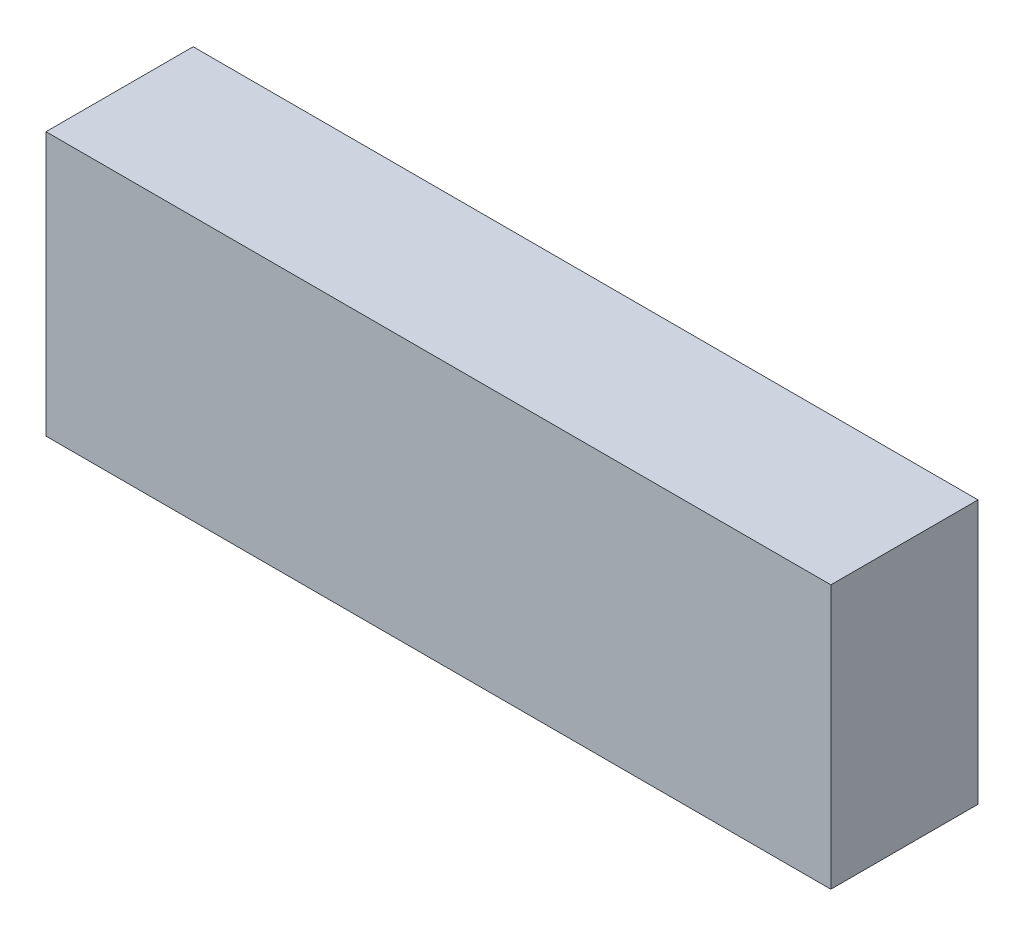
ISO-10303-21;
HEADER;
FILE_DESCRIPTION(('STEP AP214'),'2;1');
FILE_NAME('part.step','',(''),(''),'','','');
FILE_SCHEMA(('AUTOMOTIVE_DESIGN { 1 0 10303 214 1 1 1 1 }'));
ENDSEC;
DATA;
#1=APPLICATION_CONTEXT('core data for automotive mechanical design processes');
#2=APPLICATION_PROTOCOL_DEFINITION('international standard','automotive_design',2000,#1);
#3=PRODUCT_CONTEXT('',#1,'mechanical');
#4=PRODUCT('Part','Part','',(#3));
#5=PRODUCT_RELATED_PRODUCT_CATEGORY('part','',(#4));
#6=PRODUCT_DEFINITION_FORMATION('','',#4);
#7=PRODUCT_DEFINITION_CONTEXT('part definition',#1,'design');
#8=PRODUCT_DEFINITION('design','',#6,#7);
#9=PRODUCT_DEFINITION_SHAPE('','',#8);
#10=(LENGTH_UNIT() NAMED_UNIT(*) SI_UNIT(.MILLI.,.METRE.));
#11=(NAMED_UNIT(*) PLANE_ANGLE_UNIT() SI_UNIT($,.RADIAN.));
#12=(NAMED_UNIT(*) SI_UNIT($,.STERADIAN.) SOLID_ANGLE_UNIT());
#13=UNCERTAINTY_MEASURE_WITH_UNIT(LENGTH_MEASURE(1.E-05),#10,'distance_accuracy_value','');
#14=(GEOMETRIC_REPRESENTATION_CONTEXT(3) GLOBAL_UNCERTAINTY_ASSIGNED_CONTEXT((#13)) GLOBAL_UNIT_ASSIGNED_CONTEXT((#10,
#11,#12)) REPRESENTATION_CONTEXT('',''));
#15=CARTESIAN_POINT('',(0.,0.,0.));
#16=DIRECTION('',(0.,0.,1.));
#17=DIRECTION('',(1.,0.,0.));
#18=AXIS2_PLACEMENT_3D('',#15,#16,#17);
#19=CARTESIAN_POINT('',(64.,21.5,24.));
#20=DIRECTION('',(-1.,0.,0.));
#21=DIRECTION('',(0.,0.,1.));
#22=AXIS2_PLACEMENT_3D('',#19,#20,#21);
#23=PLANE('',#22);
#24=DIRECTION('',(0.,1.,0.));
#25=VECTOR('',#24,1.);
#26=CARTESIAN_POINT('',(64.,21.5,0.));
#27=LINE('',#26,#25);
#28=CARTESIAN_POINT('',(64.,-21.5,0.));
#29=VERTEX_POINT('',#28);
#30=CARTESIAN_POINT('',(64.,21.5,0.));
#31=VERTEX_POINT('',#30);
#32=EDGE_CURVE('E98',#29,#31,#27,.T.);
#33=ORIENTED_EDGE('',*,*,#32,.T.);
#34=DIRECTION('',(0.,0.,-1.));
#35=VECTOR('',#34,1.);
#36=CARTESIAN_POINT('',(64.,21.5,24.));
#37=LINE('',#36,#35);
#38=CARTESIAN_POINT('',(64.,21.5,24.));
#39=VERTEX_POINT('',#38);
#40=EDGE_CURVE('E11',#39,#31,#37,.T.);
#41=ORIENTED_EDGE('',*,*,#40,.F.);
#42=DIRECTION('',(0.,1.,0.));
#43=VECTOR('',#42,1.);
#44=CARTESIAN_POINT('',(64.,21.5,24.));
#45=LINE('',#44,#43);
#46=CARTESIAN_POINT('',(64.,-21.5,24.));
#47=VERTEX_POINT('',#46);
#48=EDGE_CURVE('E86',#47,#39,#45,.T.);
#49=ORIENTED_EDGE('',*,*,#48,.F.);
#50=DIRECTION('',(0.,0.,-1.));
#51=VECTOR('',#50,1.);
#52=CARTESIAN_POINT('',(64.,-21.5,24.));
#53=LINE('',#52,#51);
#54=EDGE_CURVE('E94',#47,#29,#53,.T.);
#55=ORIENTED_EDGE('',*,*,#54,.T.);
#56=EDGE_LOOP('',(#33,#41,#49,#55));
#57=FACE_BOUND('',#56,.T.);
#58=ADVANCED_FACE('F35',(#57),#23,.F.);
#59=CARTESIAN_POINT('',(-64.,21.5,24.));
#60=DIRECTION('',(0.,-1.,0.));
#61=DIRECTION('',(0.,0.,-1.));
#62=AXIS2_PLACEMENT_3D('',#59,#60,#61);
#63=PLANE('',#62);
#64=DIRECTION('',(-1.,0.,0.));
#65=VECTOR('',#64,1.);
#66=CARTESIAN_POINT('',(-64.,21.5,0.));
#67=LINE('',#66,#65);
#68=CARTESIAN_POINT('',(-64.,21.5,0.));
#69=VERTEX_POINT('',#68);
#70=EDGE_CURVE('E90',#31,#69,#67,.T.);
#71=ORIENTED_EDGE('',*,*,#70,.T.);
#72=DIRECTION('',(0.,0.,-1.));
#73=VECTOR('',#72,1.);
#74=CARTESIAN_POINT('',(-64.,21.5,24.));
#75=LINE('',#74,#73);
#76=CARTESIAN_POINT('',(-64.,21.5,24.));
#77=VERTEX_POINT('',#76);
#78=EDGE_CURVE('E43',#77,#69,#75,.T.);
#79=ORIENTED_EDGE('',*,*,#78,.F.);
#80=DIRECTION('',(-1.,0.,0.));
#81=VECTOR('',#80,1.);
#82=CARTESIAN_POINT('',(-64.,21.5,24.));
#83=LINE('',#82,#81);
#84=EDGE_CURVE('E81',#39,#77,#83,.T.);
#85=ORIENTED_EDGE('',*,*,#84,.F.);
#86=ORIENTED_EDGE('',*,*,#40,.T.);
#87=EDGE_LOOP('',(#71,#79,#85,#86));
#88=FACE_BOUND('',#87,.T.);
#89=ADVANCED_FACE('F89',(#88),#63,.F.);
#90=CARTESIAN_POINT('',(-64.,21.5,24.));
#91=DIRECTION('',(1.,0.,0.));
#92=DIRECTION('',(0.,1.,0.));
#93=AXIS2_PLACEMENT_3D('',#90,#91,#92);
#94=PLANE('',#93);
#95=DIRECTION('',(0.,-1.,0.));
#96=VECTOR('',#95,1.);
#97=CARTESIAN_POINT('',(-64.,21.5,0.));
#98=LINE('',#97,#96);
#99=CARTESIAN_POINT('',(-64.,-21.5,0.));
#100=VERTEX_POINT('',#99);
#101=EDGE_CURVE('E68',#69,#100,#98,.T.);
#102=ORIENTED_EDGE('',*,*,#101,.T.);
#103=DIRECTION('',(0.,0.,-1.));
#104=VECTOR('',#103,1.);
#105=CARTESIAN_POINT('',(-64.,-21.5,24.));
#106=LINE('',#105,#104);
#107=CARTESIAN_POINT('',(-64.,-21.5,24.));
#108=VERTEX_POINT('',#107);
#109=EDGE_CURVE('E91',#108,#100,#106,.T.);
#110=ORIENTED_EDGE('',*,*,#109,.F.);
#111=DIRECTION('',(0.,-1.,0.));
#112=VECTOR('',#111,1.);
#113=CARTESIAN_POINT('',(-64.,21.5,24.));
#114=LINE('',#113,#112);
#115=EDGE_CURVE('E84',#77,#108,#114,.T.);
#116=ORIENTED_EDGE('',*,*,#115,.F.);
#117=ORIENTED_EDGE('',*,*,#78,.T.);
#118=EDGE_LOOP('',(#102,#110,#116,#117));
#119=FACE_BOUND('',#118,.T.);
#120=ADVANCED_FACE('F92',(#119),#94,.F.);
#121=CARTESIAN_POINT('',(-64.,-21.5,24.));
#122=DIRECTION('',(0.,1.,0.));
#123=DIRECTION('',(0.,0.,1.));
#124=AXIS2_PLACEMENT_3D('',#121,#122,#123);
#125=PLANE('',#124);
#126=DIRECTION('',(1.,0.,0.));
#127=VECTOR('',#126,1.);
#128=CARTESIAN_POINT('',(-64.,-21.5,0.));
#129=LINE('',#128,#127);
#130=EDGE_CURVE('E74',#100,#29,#129,.T.);
#131=ORIENTED_EDGE('',*,*,#130,.T.);
#132=ORIENTED_EDGE('',*,*,#54,.F.);
#133=DIRECTION('',(1.,0.,0.));
#134=VECTOR('',#133,1.);
#135=CARTESIAN_POINT('',(-64.,-21.5,24.));
#136=LINE('',#135,#134);
#137=EDGE_CURVE('E51',#108,#47,#136,.T.);
#138=ORIENTED_EDGE('',*,*,#137,.F.);
#139=ORIENTED_EDGE('',*,*,#109,.T.);
#140=EDGE_LOOP('',(#131,#132,#138,#139));
#141=FACE_BOUND('',#140,.T.);
#142=ADVANCED_FACE('F105',(#141),#125,.F.);
#143=CARTESIAN_POINT('',(0.,0.,24.));
#144=DIRECTION('',(0.,0.,1.));
#145=DIRECTION('',(1.,0.,0.));
#146=AXIS2_PLACEMENT_3D('',#143,#144,#145);
#147=PLANE('',#146);
#148=ORIENTED_EDGE('',*,*,#48,.T.);
#149=ORIENTED_EDGE('',*,*,#84,.T.);
#150=ORIENTED_EDGE('',*,*,#115,.T.);
#151=ORIENTED_EDGE('',*,*,#137,.T.);
#152=EDGE_LOOP('',(#148,#149,#150,#151));
#153=FACE_BOUND('',#152,.T.);
#154=ADVANCED_FACE('F82',(#153),#147,.T.);
#155=CARTESIAN_POINT('',(0.,0.,0.));
#156=DIRECTION('',(0.,0.,1.));
#157=DIRECTION('',(1.,0.,0.));
#158=AXIS2_PLACEMENT_3D('',#155,#156,#157);
#159=PLANE('',#158);
#160=ORIENTED_EDGE('',*,*,#32,.F.);
#161=ORIENTED_EDGE('',*,*,#130,.F.);
#162=ORIENTED_EDGE('',*,*,#101,.F.);
#163=ORIENTED_EDGE('',*,*,#70,.F.);
#164=EDGE_LOOP('',(#160,#161,#162,#163));
#165=FACE_BOUND('',#164,.T.);
#166=ADVANCED_FACE('F108',(#165),#159,.F.);
#167=CLOSED_SHELL('',(#58,#89,#120,#142,#154,#166));
#168=MANIFOLD_SOLID_BREP('B2',#167);
#169=ADVANCED_BREP_SHAPE_REPRESENTATION('',(#18,#168),#14);
#170=SHAPE_DEFINITION_REPRESENTATION(#9,#169);
ENDSEC;
END-ISO-10303-21;
